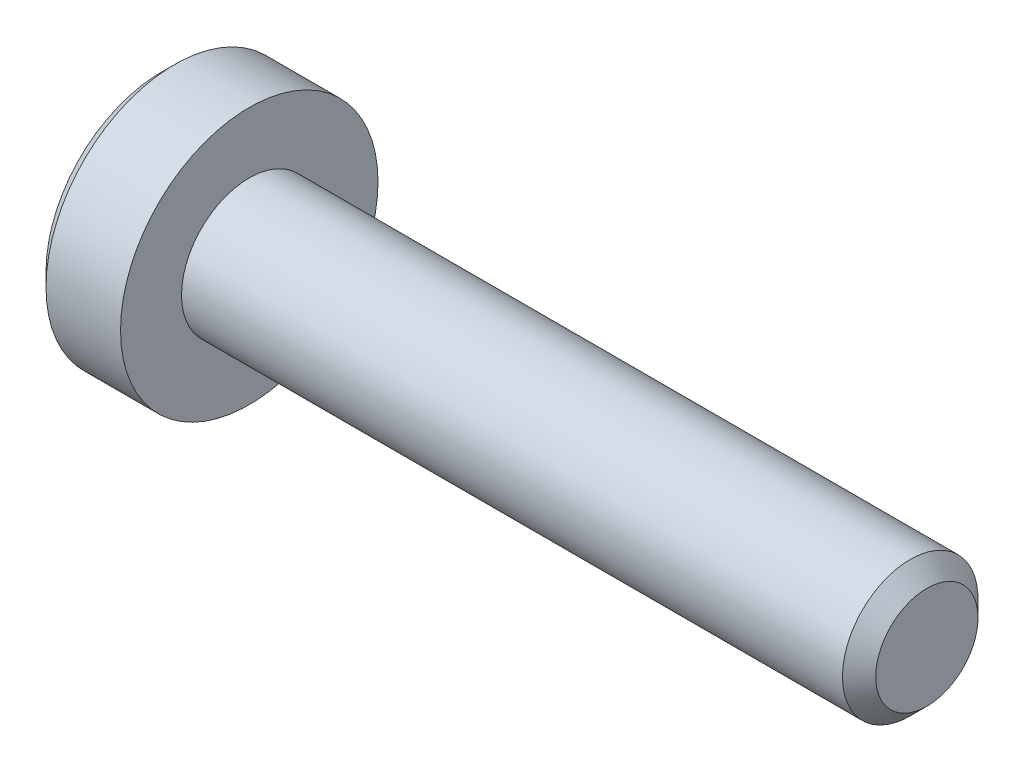
ISO-10303-21;
HEADER;
FILE_DESCRIPTION(('STEP AP214'),'2;1');
FILE_NAME('part.step','',(''),(''),'','','');
FILE_SCHEMA(('AUTOMOTIVE_DESIGN { 1 0 10303 214 1 1 1 1 }'));
ENDSEC;
DATA;
#1=APPLICATION_CONTEXT('core data for automotive mechanical design processes');
#2=APPLICATION_PROTOCOL_DEFINITION('international standard','automotive_design',2000,#1);
#3=PRODUCT_CONTEXT('',#1,'mechanical');
#4=PRODUCT('Part','Part','',(#3));
#5=PRODUCT_RELATED_PRODUCT_CATEGORY('part','',(#4));
#6=PRODUCT_DEFINITION_FORMATION('','',#4);
#7=PRODUCT_DEFINITION_CONTEXT('part definition',#1,'design');
#8=PRODUCT_DEFINITION('design','',#6,#7);
#9=PRODUCT_DEFINITION_SHAPE('','',#8);
#10=(LENGTH_UNIT() NAMED_UNIT(*) SI_UNIT(.MILLI.,.METRE.));
#11=(NAMED_UNIT(*) PLANE_ANGLE_UNIT() SI_UNIT($,.RADIAN.));
#12=(NAMED_UNIT(*) SI_UNIT($,.STERADIAN.) SOLID_ANGLE_UNIT());
#13=UNCERTAINTY_MEASURE_WITH_UNIT(LENGTH_MEASURE(1.E-05),#10,'distance_accuracy_value','');
#14=(GEOMETRIC_REPRESENTATION_CONTEXT(3) GLOBAL_UNCERTAINTY_ASSIGNED_CONTEXT((#13)) GLOBAL_UNIT_ASSIGNED_CONTEXT((#10,
#11,#12)) REPRESENTATION_CONTEXT('',''));
#15=CARTESIAN_POINT('',(0.,0.,0.));
#16=DIRECTION('',(0.,0.,1.));
#17=DIRECTION('',(1.,0.,0.));
#18=AXIS2_PLACEMENT_3D('',#15,#16,#17);
#19=CARTESIAN_POINT('',(-1.3,0.,0.));
#20=DIRECTION('',(1.,0.,0.));
#21=DIRECTION('',(0.,0.,-1.));
#22=AXIS2_PLACEMENT_3D('',#19,#20,#21);
#23=PLANE('',#22);
#24=CARTESIAN_POINT('',(-1.3,0.,0.));
#25=DIRECTION('',(-1.,0.,0.));
#26=DIRECTION('',(0.,0.,1.));
#27=AXIS2_PLACEMENT_3D('',#24,#25,#26);
#28=CIRCLE('',#27,1.7);
#29=CARTESIAN_POINT('',(-1.3,0.,1.7));
#30=VERTEX_POINT('',#29);
#31=EDGE_CURVE('E11',#30,#30,#28,.T.);
#32=ORIENTED_EDGE('',*,*,#31,.T.);
#33=EDGE_LOOP('',(#32));
#34=FACE_BOUND('',#33,.T.);
#35=DIRECTION('',(0.,-1.,0.));
#36=VECTOR('',#35,1.);
#37=CARTESIAN_POINT('',(-1.3,0.37527767497326,0.65));
#38=LINE('',#37,#36);
#39=CARTESIAN_POINT('',(-1.3,0.37527767497326,0.65));
#40=VERTEX_POINT('',#39);
#41=CARTESIAN_POINT('',(-1.3,-0.37527767497326,0.65));
#42=VERTEX_POINT('',#41);
#43=EDGE_CURVE('E51',#40,#42,#38,.T.);
#44=ORIENTED_EDGE('',*,*,#43,.T.);
#45=DIRECTION('',(0.,-0.499999999999993,-0.866025403784442));
#46=VECTOR('',#45,1.);
#47=CARTESIAN_POINT('',(-1.3,-0.37527767497326,0.65));
#48=LINE('',#47,#46);
#49=CARTESIAN_POINT('',(-1.3,-0.75055534994651,0.));
#50=VERTEX_POINT('',#49);
#51=EDGE_CURVE('E122',#42,#50,#48,.T.);
#52=ORIENTED_EDGE('',*,*,#51,.T.);
#53=DIRECTION('',(0.,0.499999999999993,-0.866025403784442));
#54=VECTOR('',#53,1.);
#55=CARTESIAN_POINT('',(-1.3,-0.75055534994651,0.));
#56=LINE('',#55,#54);
#57=CARTESIAN_POINT('',(-1.3,-0.37527767497326,-0.65));
#58=VERTEX_POINT('',#57);
#59=EDGE_CURVE('E125',#50,#58,#56,.T.);
#60=ORIENTED_EDGE('',*,*,#59,.T.);
#61=DIRECTION('',(0.,1.,0.));
#62=VECTOR('',#61,1.);
#63=CARTESIAN_POINT('',(-1.3,-0.37527767497326,-0.65));
#64=LINE('',#63,#62);
#65=CARTESIAN_POINT('',(-1.3,0.37527767497326,-0.65));
#66=VERTEX_POINT('',#65);
#67=EDGE_CURVE('E128',#58,#66,#64,.T.);
#68=ORIENTED_EDGE('',*,*,#67,.T.);
#69=DIRECTION('',(0.,0.499999999999993,0.866025403784442));
#70=VECTOR('',#69,1.);
#71=CARTESIAN_POINT('',(-1.3,0.37527767497326,-0.65));
#72=LINE('',#71,#70);
#73=CARTESIAN_POINT('',(-1.3,0.75055534994651,0.));
#74=VERTEX_POINT('',#73);
#75=EDGE_CURVE('E112',#66,#74,#72,.T.);
#76=ORIENTED_EDGE('',*,*,#75,.T.);
#77=DIRECTION('',(0.,-0.499999999999993,0.866025403784442));
#78=VECTOR('',#77,1.);
#79=CARTESIAN_POINT('',(-1.3,0.75055534994651,0.));
#80=LINE('',#79,#78);
#81=EDGE_CURVE('E131',#74,#40,#80,.T.);
#82=ORIENTED_EDGE('',*,*,#81,.T.);
#83=EDGE_LOOP('',(#44,#52,#60,#68,#76,#82));
#84=FACE_BOUND('',#83,.T.);
#85=ADVANCED_FACE('F37',(#34,#84),#23,.F.);
#86=CARTESIAN_POINT('',(-1.1,0.,0.));
#87=DIRECTION('',(1.,0.,0.));
#88=DIRECTION('',(0.,0.,-1.));
#89=AXIS2_PLACEMENT_3D('',#86,#87,#88);
#90=CONICAL_SURFACE('',#89,1.9,0.785398163397452);
#91=ORIENTED_EDGE('',*,*,#31,.F.);
#92=EDGE_LOOP('',(#91));
#93=FACE_BOUND('',#92,.T.);
#94=CARTESIAN_POINT('',(-1.1,0.,0.));
#95=DIRECTION('',(-1.,0.,0.));
#96=DIRECTION('',(0.,0.,1.));
#97=AXIS2_PLACEMENT_3D('',#94,#95,#96);
#98=CIRCLE('',#97,1.9);
#99=CARTESIAN_POINT('',(-1.1,0.,1.9));
#100=VERTEX_POINT('',#99);
#101=EDGE_CURVE('E44',#100,#100,#98,.T.);
#102=ORIENTED_EDGE('',*,*,#101,.T.);
#103=EDGE_LOOP('',(#102));
#104=FACE_BOUND('',#103,.T.);
#105=ADVANCED_FACE('F156',(#93,#104),#90,.T.);
#106=CARTESIAN_POINT('',(10.,0.,0.));
#107=DIRECTION('',(-1.,0.,0.));
#108=DIRECTION('',(0.,0.,1.));
#109=AXIS2_PLACEMENT_3D('',#106,#107,#108);
#110=CYLINDRICAL_SURFACE('',#109,1.9);
#111=ORIENTED_EDGE('',*,*,#101,.F.);
#112=EDGE_LOOP('',(#111));
#113=FACE_BOUND('',#112,.T.);
#114=CARTESIAN_POINT('',(0.,0.,0.));
#115=DIRECTION('',(-1.,0.,0.));
#116=DIRECTION('',(0.,0.,1.));
#117=AXIS2_PLACEMENT_3D('',#114,#115,#116);
#118=CIRCLE('',#117,1.9);
#119=CARTESIAN_POINT('',(0.,0.,1.9));
#120=VERTEX_POINT('',#119);
#121=EDGE_CURVE('E151',#120,#120,#118,.T.);
#122=ORIENTED_EDGE('',*,*,#121,.T.);
#123=EDGE_LOOP('',(#122));
#124=FACE_BOUND('',#123,.T.);
#125=ADVANCED_FACE('F158',(#113,#124),#110,.T.);
#126=CARTESIAN_POINT('',(0.,1.9,0.));
#127=DIRECTION('',(-1.,0.,0.));
#128=DIRECTION('',(0.,0.,1.));
#129=AXIS2_PLACEMENT_3D('',#126,#127,#128);
#130=PLANE('',#129);
#131=ORIENTED_EDGE('',*,*,#121,.F.);
#132=EDGE_LOOP('',(#131));
#133=FACE_BOUND('',#132,.T.);
#134=CARTESIAN_POINT('',(0.,0.,0.));
#135=DIRECTION('',(-1.,0.,0.));
#136=DIRECTION('',(0.,0.,1.));
#137=AXIS2_PLACEMENT_3D('',#134,#135,#136);
#138=CIRCLE('',#137,1.);
#139=CARTESIAN_POINT('',(0.,0.,1.));
#140=VERTEX_POINT('',#139);
#141=EDGE_CURVE('E148',#140,#140,#138,.T.);
#142=ORIENTED_EDGE('',*,*,#141,.T.);
#143=EDGE_LOOP('',(#142));
#144=FACE_BOUND('',#143,.T.);
#145=ADVANCED_FACE('F161',(#133,#144),#130,.F.);
#146=CARTESIAN_POINT('',(10.,0.,0.));
#147=DIRECTION('',(-1.,0.,0.));
#148=DIRECTION('',(0.,0.,1.));
#149=AXIS2_PLACEMENT_3D('',#146,#147,#148);
#150=CYLINDRICAL_SURFACE('',#149,1.);
#151=ORIENTED_EDGE('',*,*,#141,.F.);
#152=EDGE_LOOP('',(#151));
#153=FACE_BOUND('',#152,.T.);
#154=CARTESIAN_POINT('',(9.7545,0.,0.));
#155=DIRECTION('',(-1.,0.,0.));
#156=DIRECTION('',(0.,0.,1.));
#157=AXIS2_PLACEMENT_3D('',#154,#155,#156);
#158=CIRCLE('',#157,1.);
#159=CARTESIAN_POINT('',(9.7545,0.,1.));
#160=VERTEX_POINT('',#159);
#161=EDGE_CURVE('E145',#160,#160,#158,.T.);
#162=ORIENTED_EDGE('',*,*,#161,.T.);
#163=EDGE_LOOP('',(#162));
#164=FACE_BOUND('',#163,.T.);
#165=ADVANCED_FACE('F167',(#153,#164),#150,.T.);
#166=CARTESIAN_POINT('',(10.,0.,0.));
#167=DIRECTION('',(-1.,0.,0.));
#168=DIRECTION('',(0.,0.,1.));
#169=AXIS2_PLACEMENT_3D('',#166,#167,#168);
#170=CONICAL_SURFACE('',#169,0.754499999999999,0.785398163397448);
#171=ORIENTED_EDGE('',*,*,#161,.F.);
#172=EDGE_LOOP('',(#171));
#173=FACE_BOUND('',#172,.T.);
#174=CARTESIAN_POINT('',(10.,0.,0.));
#175=DIRECTION('',(-1.,0.,0.));
#176=DIRECTION('',(0.,0.,1.));
#177=AXIS2_PLACEMENT_3D('',#174,#175,#176);
#178=CIRCLE('',#177,0.754499999999999);
#179=CARTESIAN_POINT('',(10.,0.,0.754499999999999));
#180=VERTEX_POINT('',#179);
#181=EDGE_CURVE('E142',#180,#180,#178,.T.);
#182=ORIENTED_EDGE('',*,*,#181,.T.);
#183=EDGE_LOOP('',(#182));
#184=FACE_BOUND('',#183,.T.);
#185=ADVANCED_FACE('F173',(#173,#184),#170,.T.);
#186=CARTESIAN_POINT('',(10.,0.754499999999999,0.));
#187=DIRECTION('',(-1.,0.,0.));
#188=DIRECTION('',(0.,0.,1.));
#189=AXIS2_PLACEMENT_3D('',#186,#187,#188);
#190=PLANE('',#189);
#191=ORIENTED_EDGE('',*,*,#181,.F.);
#192=EDGE_LOOP('',(#191));
#193=FACE_BOUND('',#192,.T.);
#194=ADVANCED_FACE('F179',(#193),#190,.F.);
#195=CARTESIAN_POINT('',(-0.6,0.37527767497326,0.65));
#196=DIRECTION('',(0.,0.,-1.));
#197=DIRECTION('',(-1.,0.,0.));
#198=AXIS2_PLACEMENT_3D('',#195,#196,#197);
#199=PLANE('',#198);
#200=ORIENTED_EDGE('',*,*,#43,.F.);
#201=DIRECTION('',(-1.,0.,0.));
#202=VECTOR('',#201,1.);
#203=CARTESIAN_POINT('',(-0.6,0.37527767497326,0.65));
#204=LINE('',#203,#202);
#205=CARTESIAN_POINT('',(-0.6,0.37527767497326,0.65));
#206=VERTEX_POINT('',#205);
#207=EDGE_CURVE('E117',#206,#40,#204,.T.);
#208=ORIENTED_EDGE('',*,*,#207,.F.);
#209=DIRECTION('',(0.,-1.,0.));
#210=VECTOR('',#209,1.);
#211=CARTESIAN_POINT('',(-0.6,0.37527767497326,0.65));
#212=LINE('',#211,#210);
#213=CARTESIAN_POINT('',(-0.6,-0.37527767497326,0.65));
#214=VERTEX_POINT('',#213);
#215=EDGE_CURVE('E134',#206,#214,#212,.T.);
#216=ORIENTED_EDGE('',*,*,#215,.T.);
#217=DIRECTION('',(-1.,0.,0.));
#218=VECTOR('',#217,1.);
#219=CARTESIAN_POINT('',(-0.6,-0.37527767497326,0.65));
#220=LINE('',#219,#218);
#221=EDGE_CURVE('E140',#214,#42,#220,.T.);
#222=ORIENTED_EDGE('',*,*,#221,.T.);
#223=EDGE_LOOP('',(#200,#208,#216,#222));
#224=FACE_BOUND('',#223,.T.);
#225=ADVANCED_FACE('F184',(#224),#199,.T.);
#226=CARTESIAN_POINT('',(-0.6,-0.37527767497326,0.65));
#227=DIRECTION('',(0.,0.866025403784442,-0.499999999999993));
#228=DIRECTION('',(0.,0.499999999999993,0.866025403784442));
#229=AXIS2_PLACEMENT_3D('',#226,#227,#228);
#230=PLANE('',#229);
#231=ORIENTED_EDGE('',*,*,#51,.F.);
#232=ORIENTED_EDGE('',*,*,#221,.F.);
#233=DIRECTION('',(0.,-0.499999999999993,-0.866025403784442));
#234=VECTOR('',#233,1.);
#235=CARTESIAN_POINT('',(-0.6,-0.37527767497326,0.65));
#236=LINE('',#235,#234);
#237=CARTESIAN_POINT('',(-0.6,-0.75055534994651,0.));
#238=VERTEX_POINT('',#237);
#239=EDGE_CURVE('E90',#214,#238,#236,.T.);
#240=ORIENTED_EDGE('',*,*,#239,.T.);
#241=DIRECTION('',(-1.,0.,0.));
#242=VECTOR('',#241,1.);
#243=CARTESIAN_POINT('',(-0.6,-0.75055534994651,0.));
#244=LINE('',#243,#242);
#245=EDGE_CURVE('E138',#238,#50,#244,.T.);
#246=ORIENTED_EDGE('',*,*,#245,.T.);
#247=EDGE_LOOP('',(#231,#232,#240,#246));
#248=FACE_BOUND('',#247,.T.);
#249=ADVANCED_FACE('F189',(#248),#230,.T.);
#250=CARTESIAN_POINT('',(-0.6,-0.75055534994651,0.));
#251=DIRECTION('',(0.,0.866025403784442,0.499999999999993));
#252=DIRECTION('',(0.,-0.499999999999993,0.866025403784442));
#253=AXIS2_PLACEMENT_3D('',#250,#251,#252);
#254=PLANE('',#253);
#255=ORIENTED_EDGE('',*,*,#59,.F.);
#256=ORIENTED_EDGE('',*,*,#245,.F.);
#257=DIRECTION('',(0.,0.499999999999993,-0.866025403784442));
#258=VECTOR('',#257,1.);
#259=CARTESIAN_POINT('',(-0.6,-0.75055534994651,0.));
#260=LINE('',#259,#258);
#261=CARTESIAN_POINT('',(-0.6,-0.37527767497326,-0.65));
#262=VERTEX_POINT('',#261);
#263=EDGE_CURVE('E108',#238,#262,#260,.T.);
#264=ORIENTED_EDGE('',*,*,#263,.T.);
#265=DIRECTION('',(-1.,0.,0.));
#266=VECTOR('',#265,1.);
#267=CARTESIAN_POINT('',(-0.6,-0.37527767497326,-0.65));
#268=LINE('',#267,#266);
#269=EDGE_CURVE('E105',#262,#58,#268,.T.);
#270=ORIENTED_EDGE('',*,*,#269,.T.);
#271=EDGE_LOOP('',(#255,#256,#264,#270));
#272=FACE_BOUND('',#271,.T.);
#273=ADVANCED_FACE('F206',(#272),#254,.T.);
#274=CARTESIAN_POINT('',(-0.6,-0.37527767497326,-0.65));
#275=DIRECTION('',(0.,0.,1.));
#276=DIRECTION('',(1.,0.,0.));
#277=AXIS2_PLACEMENT_3D('',#274,#275,#276);
#278=PLANE('',#277);
#279=ORIENTED_EDGE('',*,*,#67,.F.);
#280=ORIENTED_EDGE('',*,*,#269,.F.);
#281=DIRECTION('',(0.,1.,0.));
#282=VECTOR('',#281,1.);
#283=CARTESIAN_POINT('',(-0.6,-0.37527767497326,-0.65));
#284=LINE('',#283,#282);
#285=CARTESIAN_POINT('',(-0.6,0.37527767497326,-0.65));
#286=VERTEX_POINT('',#285);
#287=EDGE_CURVE('E100',#262,#286,#284,.T.);
#288=ORIENTED_EDGE('',*,*,#287,.T.);
#289=DIRECTION('',(-1.,0.,0.));
#290=VECTOR('',#289,1.);
#291=CARTESIAN_POINT('',(-0.6,0.37527767497326,-0.65));
#292=LINE('',#291,#290);
#293=EDGE_CURVE('E104',#286,#66,#292,.T.);
#294=ORIENTED_EDGE('',*,*,#293,.T.);
#295=EDGE_LOOP('',(#279,#280,#288,#294));
#296=FACE_BOUND('',#295,.T.);
#297=ADVANCED_FACE('F103',(#296),#278,.T.);
#298=CARTESIAN_POINT('',(-0.6,0.37527767497326,-0.65));
#299=DIRECTION('',(0.,-0.866025403784442,0.499999999999993));
#300=DIRECTION('',(0.,-0.499999999999993,-0.866025403784442));
#301=AXIS2_PLACEMENT_3D('',#298,#299,#300);
#302=PLANE('',#301);
#303=ORIENTED_EDGE('',*,*,#75,.F.);
#304=ORIENTED_EDGE('',*,*,#293,.F.);
#305=DIRECTION('',(0.,0.499999999999993,0.866025403784442));
#306=VECTOR('',#305,1.);
#307=CARTESIAN_POINT('',(-0.6,0.37527767497326,-0.65));
#308=LINE('',#307,#306);
#309=CARTESIAN_POINT('',(-0.6,0.75055534994651,0.));
#310=VERTEX_POINT('',#309);
#311=EDGE_CURVE('E107',#286,#310,#308,.T.);
#312=ORIENTED_EDGE('',*,*,#311,.T.);
#313=DIRECTION('',(-1.,0.,0.));
#314=VECTOR('',#313,1.);
#315=CARTESIAN_POINT('',(-0.6,0.75055534994651,0.));
#316=LINE('',#315,#314);
#317=EDGE_CURVE('E81',#310,#74,#316,.T.);
#318=ORIENTED_EDGE('',*,*,#317,.T.);
#319=EDGE_LOOP('',(#303,#304,#312,#318));
#320=FACE_BOUND('',#319,.T.);
#321=ADVANCED_FACE('F110',(#320),#302,.T.);
#322=CARTESIAN_POINT('',(-0.6,0.75055534994651,0.));
#323=DIRECTION('',(0.,-0.866025403784442,-0.499999999999993));
#324=DIRECTION('',(0.,0.499999999999993,-0.866025403784442));
#325=AXIS2_PLACEMENT_3D('',#322,#323,#324);
#326=PLANE('',#325);
#327=ORIENTED_EDGE('',*,*,#81,.F.);
#328=ORIENTED_EDGE('',*,*,#317,.F.);
#329=DIRECTION('',(0.,-0.499999999999993,0.866025403784442));
#330=VECTOR('',#329,1.);
#331=CARTESIAN_POINT('',(-0.6,0.75055534994651,0.));
#332=LINE('',#331,#330);
#333=EDGE_CURVE('E59',#310,#206,#332,.T.);
#334=ORIENTED_EDGE('',*,*,#333,.T.);
#335=ORIENTED_EDGE('',*,*,#207,.T.);
#336=EDGE_LOOP('',(#327,#328,#334,#335));
#337=FACE_BOUND('',#336,.T.);
#338=ADVANCED_FACE('F199',(#337),#326,.T.);
#339=CARTESIAN_POINT('',(-0.6,0.,0.));
#340=DIRECTION('',(1.,0.,0.));
#341=DIRECTION('',(0.,0.,-1.));
#342=AXIS2_PLACEMENT_3D('',#339,#340,#341);
#343=PLANE('',#342);
#344=ORIENTED_EDGE('',*,*,#215,.F.);
#345=ORIENTED_EDGE('',*,*,#333,.F.);
#346=ORIENTED_EDGE('',*,*,#311,.F.);
#347=ORIENTED_EDGE('',*,*,#287,.F.);
#348=ORIENTED_EDGE('',*,*,#263,.F.);
#349=ORIENTED_EDGE('',*,*,#239,.F.);
#350=EDGE_LOOP('',(#344,#345,#346,#347,#348,#349));
#351=FACE_BOUND('',#350,.T.);
#352=ADVANCED_FACE('F115',(#351),#343,.F.);
#353=CLOSED_SHELL('',(#85,#105,#125,#145,#165,#185,#194,#225,#249,#273,#297,#321,#338,#352));
#354=MANIFOLD_SOLID_BREP('B2',#353);
#355=ADVANCED_BREP_SHAPE_REPRESENTATION('',(#18,#354),#14);
#356=SHAPE_DEFINITION_REPRESENTATION(#9,#355);
ENDSEC;
END-ISO-10303-21;
